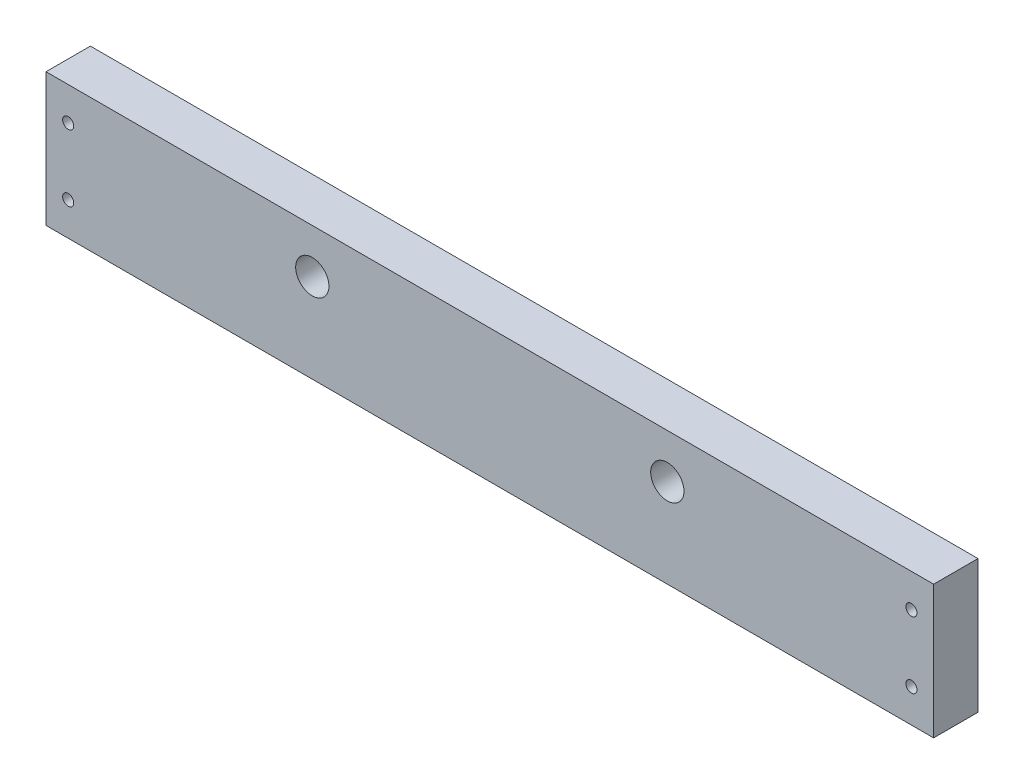
ISO-10303-21;
HEADER;
FILE_DESCRIPTION(('STEP AP214'),'2;1');
FILE_NAME('part.step','',(''),(''),'','','');
FILE_SCHEMA(('AUTOMOTIVE_DESIGN { 1 0 10303 214 1 1 1 1 }'));
ENDSEC;
DATA;
#1=APPLICATION_CONTEXT('core data for automotive mechanical design processes');
#2=APPLICATION_PROTOCOL_DEFINITION('international standard','automotive_design',2000,#1);
#3=PRODUCT_CONTEXT('',#1,'mechanical');
#4=PRODUCT('Part','Part','',(#3));
#5=PRODUCT_RELATED_PRODUCT_CATEGORY('part','',(#4));
#6=PRODUCT_DEFINITION_FORMATION('','',#4);
#7=PRODUCT_DEFINITION_CONTEXT('part definition',#1,'design');
#8=PRODUCT_DEFINITION('design','',#6,#7);
#9=PRODUCT_DEFINITION_SHAPE('','',#8);
#10=(LENGTH_UNIT() NAMED_UNIT(*) SI_UNIT(.MILLI.,.METRE.));
#11=(NAMED_UNIT(*) PLANE_ANGLE_UNIT() SI_UNIT($,.RADIAN.));
#12=(NAMED_UNIT(*) SI_UNIT($,.STERADIAN.) SOLID_ANGLE_UNIT());
#13=UNCERTAINTY_MEASURE_WITH_UNIT(LENGTH_MEASURE(1.E-05),#10,'distance_accuracy_value','');
#14=(GEOMETRIC_REPRESENTATION_CONTEXT(3) GLOBAL_UNCERTAINTY_ASSIGNED_CONTEXT((#13)) GLOBAL_UNIT_ASSIGNED_CONTEXT((#10,
#11,#12)) REPRESENTATION_CONTEXT('',''));
#15=CARTESIAN_POINT('',(0.,0.,0.));
#16=DIRECTION('',(0.,0.,1.));
#17=DIRECTION('',(1.,0.,0.));
#18=AXIS2_PLACEMENT_3D('',#15,#16,#17);
#19=CARTESIAN_POINT('',(-127.,12.7,12.7));
#20=DIRECTION('',(0.,0.,-1.));
#21=DIRECTION('',(-1.,0.,0.));
#22=AXIS2_PLACEMENT_3D('',#19,#20,#21);
#23=PLANE('',#22);
#24=CARTESIAN_POINT('',(120.65,3.175,12.7));
#25=DIRECTION('',(0.,0.,1.));
#26=DIRECTION('',(1.,0.,0.));
#27=AXIS2_PLACEMENT_3D('',#24,#25,#26);
#28=CIRCLE('',#27,1.5875);
#29=CARTESIAN_POINT('',(122.2375,3.175,12.7));
#30=VERTEX_POINT('',#29);
#31=EDGE_CURVE('E131',#30,#30,#28,.T.);
#32=ORIENTED_EDGE('',*,*,#31,.F.);
#33=EDGE_LOOP('',(#32));
#34=FACE_BOUND('',#33,.T.);
#35=CARTESIAN_POINT('',(-120.65,3.175,12.7));
#36=DIRECTION('',(0.,0.,1.));
#37=DIRECTION('',(1.,0.,0.));
#38=AXIS2_PLACEMENT_3D('',#35,#36,#37);
#39=CIRCLE('',#38,1.5875);
#40=CARTESIAN_POINT('',(-119.0625,3.175,12.7));
#41=VERTEX_POINT('',#40);
#42=EDGE_CURVE('E119',#41,#41,#39,.T.);
#43=ORIENTED_EDGE('',*,*,#42,.F.);
#44=EDGE_LOOP('',(#43));
#45=FACE_BOUND('',#44,.T.);
#46=CARTESIAN_POINT('',(-50.8,0.,12.7));
#47=DIRECTION('',(0.,0.,1.));
#48=DIRECTION('',(1.,0.,0.));
#49=AXIS2_PLACEMENT_3D('',#46,#47,#48);
#50=CIRCLE('',#49,4.7625);
#51=CARTESIAN_POINT('',(-46.0375,0.,12.7));
#52=VERTEX_POINT('',#51);
#53=EDGE_CURVE('E98',#52,#52,#50,.T.);
#54=ORIENTED_EDGE('',*,*,#53,.F.);
#55=EDGE_LOOP('',(#54));
#56=FACE_BOUND('',#55,.T.);
#57=DIRECTION('',(0.,-1.,0.));
#58=VECTOR('',#57,1.);
#59=CARTESIAN_POINT('',(-127.,-25.4,12.7));
#60=LINE('',#59,#58);
#61=CARTESIAN_POINT('',(-127.,12.7,12.7));
#62=VERTEX_POINT('',#61);
#63=CARTESIAN_POINT('',(-127.,-25.4,12.7));
#64=VERTEX_POINT('',#63);
#65=EDGE_CURVE('E83',#62,#64,#60,.T.);
#66=ORIENTED_EDGE('',*,*,#65,.T.);
#67=DIRECTION('',(1.,0.,0.));
#68=VECTOR('',#67,1.);
#69=CARTESIAN_POINT('',(127.,-25.4,12.7));
#70=LINE('',#69,#68);
#71=CARTESIAN_POINT('',(127.,-25.4,12.7));
#72=VERTEX_POINT('',#71);
#73=EDGE_CURVE('E78',#64,#72,#70,.T.);
#74=ORIENTED_EDGE('',*,*,#73,.T.);
#75=DIRECTION('',(0.,1.,0.));
#76=VECTOR('',#75,1.);
#77=CARTESIAN_POINT('',(127.,12.7,12.7));
#78=LINE('',#77,#76);
#79=CARTESIAN_POINT('',(127.,12.7,12.7));
#80=VERTEX_POINT('',#79);
#81=EDGE_CURVE('E81',#72,#80,#78,.T.);
#82=ORIENTED_EDGE('',*,*,#81,.T.);
#83=DIRECTION('',(-1.,0.,0.));
#84=VECTOR('',#83,1.);
#85=CARTESIAN_POINT('',(-127.,12.7,12.7));
#86=LINE('',#85,#84);
#87=EDGE_CURVE('E48',#80,#62,#86,.T.);
#88=ORIENTED_EDGE('',*,*,#87,.T.);
#89=EDGE_LOOP('',(#66,#74,#82,#88));
#90=FACE_BOUND('',#89,.T.);
#91=CARTESIAN_POINT('',(50.8,0.,12.7));
#92=DIRECTION('',(0.,0.,1.));
#93=DIRECTION('',(1.,0.,0.));
#94=AXIS2_PLACEMENT_3D('',#91,#92,#93);
#95=CIRCLE('',#94,4.7625);
#96=CARTESIAN_POINT('',(55.5625,0.,12.7));
#97=VERTEX_POINT('',#96);
#98=EDGE_CURVE('E113',#97,#97,#95,.T.);
#99=ORIENTED_EDGE('',*,*,#98,.F.);
#100=EDGE_LOOP('',(#99));
#101=FACE_BOUND('',#100,.T.);
#102=CARTESIAN_POINT('',(-120.65,-15.875,12.7));
#103=DIRECTION('',(0.,0.,1.));
#104=DIRECTION('',(1.,0.,0.));
#105=AXIS2_PLACEMENT_3D('',#102,#103,#104);
#106=CIRCLE('',#105,1.5875);
#107=CARTESIAN_POINT('',(-119.0625,-15.875,12.7));
#108=VERTEX_POINT('',#107);
#109=EDGE_CURVE('E125',#108,#108,#106,.T.);
#110=ORIENTED_EDGE('',*,*,#109,.F.);
#111=EDGE_LOOP('',(#110));
#112=FACE_BOUND('',#111,.T.);
#113=CARTESIAN_POINT('',(120.65,-15.875,12.7));
#114=DIRECTION('',(0.,0.,1.));
#115=DIRECTION('',(1.,0.,0.));
#116=AXIS2_PLACEMENT_3D('',#113,#114,#115);
#117=CIRCLE('',#116,1.5875);
#118=CARTESIAN_POINT('',(122.2375,-15.875,12.7));
#119=VERTEX_POINT('',#118);
#120=EDGE_CURVE('E137',#119,#119,#117,.T.);
#121=ORIENTED_EDGE('',*,*,#120,.F.);
#122=EDGE_LOOP('',(#121));
#123=FACE_BOUND('',#122,.T.);
#124=ADVANCED_FACE('F31',(#34,#45,#56,#90,#101,#112,#123),#23,.F.);
#125=CARTESIAN_POINT('',(-127.,12.7,0.));
#126=DIRECTION('',(0.,0.,-1.));
#127=DIRECTION('',(-1.,0.,0.));
#128=AXIS2_PLACEMENT_3D('',#125,#126,#127);
#129=PLANE('',#128);
#130=CARTESIAN_POINT('',(120.65,3.175,0.));
#131=DIRECTION('',(0.,0.,1.));
#132=DIRECTION('',(1.,0.,0.));
#133=AXIS2_PLACEMENT_3D('',#130,#131,#132);
#134=CIRCLE('',#133,1.5875);
#135=CARTESIAN_POINT('',(122.2375,3.175,0.));
#136=VERTEX_POINT('',#135);
#137=EDGE_CURVE('E134',#136,#136,#134,.T.);
#138=ORIENTED_EDGE('',*,*,#137,.T.);
#139=EDGE_LOOP('',(#138));
#140=FACE_BOUND('',#139,.T.);
#141=CARTESIAN_POINT('',(-120.65,3.175,0.));
#142=DIRECTION('',(0.,0.,1.));
#143=DIRECTION('',(1.,0.,0.));
#144=AXIS2_PLACEMENT_3D('',#141,#142,#143);
#145=CIRCLE('',#144,1.5875);
#146=CARTESIAN_POINT('',(-119.0625,3.175,0.));
#147=VERTEX_POINT('',#146);
#148=EDGE_CURVE('E122',#147,#147,#145,.T.);
#149=ORIENTED_EDGE('',*,*,#148,.T.);
#150=EDGE_LOOP('',(#149));
#151=FACE_BOUND('',#150,.T.);
#152=CARTESIAN_POINT('',(-50.8,0.,0.));
#153=DIRECTION('',(0.,0.,1.));
#154=DIRECTION('',(1.,0.,0.));
#155=AXIS2_PLACEMENT_3D('',#152,#153,#154);
#156=CIRCLE('',#155,4.7625);
#157=CARTESIAN_POINT('',(-46.0375,0.,0.));
#158=VERTEX_POINT('',#157);
#159=EDGE_CURVE('E110',#158,#158,#156,.T.);
#160=ORIENTED_EDGE('',*,*,#159,.T.);
#161=EDGE_LOOP('',(#160));
#162=FACE_BOUND('',#161,.T.);
#163=DIRECTION('',(0.,-1.,0.));
#164=VECTOR('',#163,1.);
#165=CARTESIAN_POINT('',(-127.,-25.4,0.));
#166=LINE('',#165,#164);
#167=CARTESIAN_POINT('',(-127.,12.7,0.));
#168=VERTEX_POINT('',#167);
#169=CARTESIAN_POINT('',(-127.,-25.4,0.));
#170=VERTEX_POINT('',#169);
#171=EDGE_CURVE('E95',#168,#170,#166,.T.);
#172=ORIENTED_EDGE('',*,*,#171,.F.);
#173=DIRECTION('',(-1.,0.,0.));
#174=VECTOR('',#173,1.);
#175=CARTESIAN_POINT('',(-127.,12.7,0.));
#176=LINE('',#175,#174);
#177=CARTESIAN_POINT('',(127.,12.7,0.));
#178=VERTEX_POINT('',#177);
#179=EDGE_CURVE('E71',#178,#168,#176,.T.);
#180=ORIENTED_EDGE('',*,*,#179,.F.);
#181=DIRECTION('',(0.,1.,0.));
#182=VECTOR('',#181,1.);
#183=CARTESIAN_POINT('',(127.,12.7,0.));
#184=LINE('',#183,#182);
#185=CARTESIAN_POINT('',(127.,-25.4,0.));
#186=VERTEX_POINT('',#185);
#187=EDGE_CURVE('E65',#186,#178,#184,.T.);
#188=ORIENTED_EDGE('',*,*,#187,.F.);
#189=DIRECTION('',(1.,0.,0.));
#190=VECTOR('',#189,1.);
#191=CARTESIAN_POINT('',(127.,-25.4,0.));
#192=LINE('',#191,#190);
#193=EDGE_CURVE('E87',#170,#186,#192,.T.);
#194=ORIENTED_EDGE('',*,*,#193,.F.);
#195=EDGE_LOOP('',(#172,#180,#188,#194));
#196=FACE_BOUND('',#195,.T.);
#197=CARTESIAN_POINT('',(50.8,0.,0.));
#198=DIRECTION('',(0.,0.,1.));
#199=DIRECTION('',(1.,0.,0.));
#200=AXIS2_PLACEMENT_3D('',#197,#198,#199);
#201=CIRCLE('',#200,4.7625);
#202=CARTESIAN_POINT('',(55.5625,0.,0.));
#203=VERTEX_POINT('',#202);
#204=EDGE_CURVE('E116',#203,#203,#201,.T.);
#205=ORIENTED_EDGE('',*,*,#204,.T.);
#206=EDGE_LOOP('',(#205));
#207=FACE_BOUND('',#206,.T.);
#208=CARTESIAN_POINT('',(-120.65,-15.875,0.));
#209=DIRECTION('',(0.,0.,1.));
#210=DIRECTION('',(1.,0.,0.));
#211=AXIS2_PLACEMENT_3D('',#208,#209,#210);
#212=CIRCLE('',#211,1.5875);
#213=CARTESIAN_POINT('',(-119.0625,-15.875,0.));
#214=VERTEX_POINT('',#213);
#215=EDGE_CURVE('E128',#214,#214,#212,.T.);
#216=ORIENTED_EDGE('',*,*,#215,.T.);
#217=EDGE_LOOP('',(#216));
#218=FACE_BOUND('',#217,.T.);
#219=CARTESIAN_POINT('',(120.65,-15.875,0.));
#220=DIRECTION('',(0.,0.,1.));
#221=DIRECTION('',(1.,0.,0.));
#222=AXIS2_PLACEMENT_3D('',#219,#220,#221);
#223=CIRCLE('',#222,1.5875);
#224=CARTESIAN_POINT('',(122.2375,-15.875,0.));
#225=VERTEX_POINT('',#224);
#226=EDGE_CURVE('E140',#225,#225,#223,.T.);
#227=ORIENTED_EDGE('',*,*,#226,.T.);
#228=EDGE_LOOP('',(#227));
#229=FACE_BOUND('',#228,.T.);
#230=ADVANCED_FACE('F106',(#140,#151,#162,#196,#207,#218,#229),#129,.T.);
#231=CARTESIAN_POINT('',(-127.,-25.4,12.7));
#232=DIRECTION('',(1.,0.,0.));
#233=DIRECTION('',(0.,0.,-1.));
#234=AXIS2_PLACEMENT_3D('',#231,#232,#233);
#235=PLANE('',#234);
#236=ORIENTED_EDGE('',*,*,#171,.T.);
#237=DIRECTION('',(0.,0.,-1.));
#238=VECTOR('',#237,1.);
#239=CARTESIAN_POINT('',(-127.,-25.4,12.7));
#240=LINE('',#239,#238);
#241=EDGE_CURVE('E11',#64,#170,#240,.T.);
#242=ORIENTED_EDGE('',*,*,#241,.F.);
#243=ORIENTED_EDGE('',*,*,#65,.F.);
#244=DIRECTION('',(0.,0.,-1.));
#245=VECTOR('',#244,1.);
#246=CARTESIAN_POINT('',(-127.,12.7,12.7));
#247=LINE('',#246,#245);
#248=EDGE_CURVE('E91',#62,#168,#247,.T.);
#249=ORIENTED_EDGE('',*,*,#248,.T.);
#250=EDGE_LOOP('',(#236,#242,#243,#249));
#251=FACE_BOUND('',#250,.T.);
#252=ADVANCED_FACE('F33',(#251),#235,.F.);
#253=CARTESIAN_POINT('',(127.,-25.4,12.7));
#254=DIRECTION('',(0.,1.,0.));
#255=DIRECTION('',(0.,0.,1.));
#256=AXIS2_PLACEMENT_3D('',#253,#254,#255);
#257=PLANE('',#256);
#258=ORIENTED_EDGE('',*,*,#193,.T.);
#259=DIRECTION('',(0.,0.,-1.));
#260=VECTOR('',#259,1.);
#261=CARTESIAN_POINT('',(127.,-25.4,12.7));
#262=LINE('',#261,#260);
#263=EDGE_CURVE('E40',#72,#186,#262,.T.);
#264=ORIENTED_EDGE('',*,*,#263,.F.);
#265=ORIENTED_EDGE('',*,*,#73,.F.);
#266=ORIENTED_EDGE('',*,*,#241,.T.);
#267=EDGE_LOOP('',(#258,#264,#265,#266));
#268=FACE_BOUND('',#267,.T.);
#269=ADVANCED_FACE('F86',(#268),#257,.F.);
#270=CARTESIAN_POINT('',(127.,12.7,12.7));
#271=DIRECTION('',(-1.,0.,0.));
#272=DIRECTION('',(0.,0.,1.));
#273=AXIS2_PLACEMENT_3D('',#270,#271,#272);
#274=PLANE('',#273);
#275=ORIENTED_EDGE('',*,*,#187,.T.);
#276=DIRECTION('',(0.,0.,-1.));
#277=VECTOR('',#276,1.);
#278=CARTESIAN_POINT('',(127.,12.7,12.7));
#279=LINE('',#278,#277);
#280=EDGE_CURVE('E88',#80,#178,#279,.T.);
#281=ORIENTED_EDGE('',*,*,#280,.F.);
#282=ORIENTED_EDGE('',*,*,#81,.F.);
#283=ORIENTED_EDGE('',*,*,#263,.T.);
#284=EDGE_LOOP('',(#275,#281,#282,#283));
#285=FACE_BOUND('',#284,.T.);
#286=ADVANCED_FACE('F89',(#285),#274,.F.);
#287=CARTESIAN_POINT('',(-127.,12.7,12.7));
#288=DIRECTION('',(0.,-1.,0.));
#289=DIRECTION('',(0.,0.,-1.));
#290=AXIS2_PLACEMENT_3D('',#287,#288,#289);
#291=PLANE('',#290);
#292=ORIENTED_EDGE('',*,*,#179,.T.);
#293=ORIENTED_EDGE('',*,*,#248,.F.);
#294=ORIENTED_EDGE('',*,*,#87,.F.);
#295=ORIENTED_EDGE('',*,*,#280,.T.);
#296=EDGE_LOOP('',(#292,#293,#294,#295));
#297=FACE_BOUND('',#296,.T.);
#298=ADVANCED_FACE('F103',(#297),#291,.F.);
#299=CARTESIAN_POINT('',(-50.8,0.,12.7));
#300=DIRECTION('',(0.,0.,-1.));
#301=DIRECTION('',(-1.,0.,0.));
#302=AXIS2_PLACEMENT_3D('',#299,#300,#301);
#303=CYLINDRICAL_SURFACE('',#302,4.7625);
#304=ORIENTED_EDGE('',*,*,#53,.T.);
#305=EDGE_LOOP('',(#304));
#306=FACE_BOUND('',#305,.T.);
#307=ORIENTED_EDGE('',*,*,#159,.F.);
#308=EDGE_LOOP('',(#307));
#309=FACE_BOUND('',#308,.T.);
#310=ADVANCED_FACE('F160',(#306,#309),#303,.F.);
#311=CARTESIAN_POINT('',(50.8,0.,12.7));
#312=DIRECTION('',(0.,0.,-1.));
#313=DIRECTION('',(-1.,0.,0.));
#314=AXIS2_PLACEMENT_3D('',#311,#312,#313);
#315=CYLINDRICAL_SURFACE('',#314,4.7625);
#316=ORIENTED_EDGE('',*,*,#98,.T.);
#317=EDGE_LOOP('',(#316));
#318=FACE_BOUND('',#317,.T.);
#319=ORIENTED_EDGE('',*,*,#204,.F.);
#320=EDGE_LOOP('',(#319));
#321=FACE_BOUND('',#320,.T.);
#322=ADVANCED_FACE('F206',(#318,#321),#315,.F.);
#323=CARTESIAN_POINT('',(-120.65,3.175,12.7));
#324=DIRECTION('',(0.,0.,-1.));
#325=DIRECTION('',(-1.,0.,0.));
#326=AXIS2_PLACEMENT_3D('',#323,#324,#325);
#327=CYLINDRICAL_SURFACE('',#326,1.5875);
#328=ORIENTED_EDGE('',*,*,#42,.T.);
#329=EDGE_LOOP('',(#328));
#330=FACE_BOUND('',#329,.T.);
#331=ORIENTED_EDGE('',*,*,#148,.F.);
#332=EDGE_LOOP('',(#331));
#333=FACE_BOUND('',#332,.T.);
#334=ADVANCED_FACE('F214',(#330,#333),#327,.F.);
#335=CARTESIAN_POINT('',(-120.65,-15.875,12.7));
#336=DIRECTION('',(0.,0.,-1.));
#337=DIRECTION('',(-1.,0.,0.));
#338=AXIS2_PLACEMENT_3D('',#335,#336,#337);
#339=CYLINDRICAL_SURFACE('',#338,1.5875);
#340=ORIENTED_EDGE('',*,*,#109,.T.);
#341=EDGE_LOOP('',(#340));
#342=FACE_BOUND('',#341,.T.);
#343=ORIENTED_EDGE('',*,*,#215,.F.);
#344=EDGE_LOOP('',(#343));
#345=FACE_BOUND('',#344,.T.);
#346=ADVANCED_FACE('F222',(#342,#345),#339,.F.);
#347=CARTESIAN_POINT('',(120.65,3.175,12.7));
#348=DIRECTION('',(0.,0.,-1.));
#349=DIRECTION('',(-1.,0.,0.));
#350=AXIS2_PLACEMENT_3D('',#347,#348,#349);
#351=CYLINDRICAL_SURFACE('',#350,1.5875);
#352=ORIENTED_EDGE('',*,*,#31,.T.);
#353=EDGE_LOOP('',(#352));
#354=FACE_BOUND('',#353,.T.);
#355=ORIENTED_EDGE('',*,*,#137,.F.);
#356=EDGE_LOOP('',(#355));
#357=FACE_BOUND('',#356,.T.);
#358=ADVANCED_FACE('F231',(#354,#357),#351,.F.);
#359=CARTESIAN_POINT('',(120.65,-15.875,12.7));
#360=DIRECTION('',(0.,0.,-1.));
#361=DIRECTION('',(-1.,0.,0.));
#362=AXIS2_PLACEMENT_3D('',#359,#360,#361);
#363=CYLINDRICAL_SURFACE('',#362,1.5875);
#364=ORIENTED_EDGE('',*,*,#120,.T.);
#365=EDGE_LOOP('',(#364));
#366=FACE_BOUND('',#365,.T.);
#367=ORIENTED_EDGE('',*,*,#226,.F.);
#368=EDGE_LOOP('',(#367));
#369=FACE_BOUND('',#368,.T.);
#370=ADVANCED_FACE('F146',(#366,#369),#363,.F.);
#371=CLOSED_SHELL('',(#124,#230,#252,#269,#286,#298,#310,#322,#334,#346,#358,#370));
#372=MANIFOLD_SOLID_BREP('B2',#371);
#373=ADVANCED_BREP_SHAPE_REPRESENTATION('',(#18,#372),#14);
#374=SHAPE_DEFINITION_REPRESENTATION(#9,#373);
ENDSEC;
END-ISO-10303-21;
